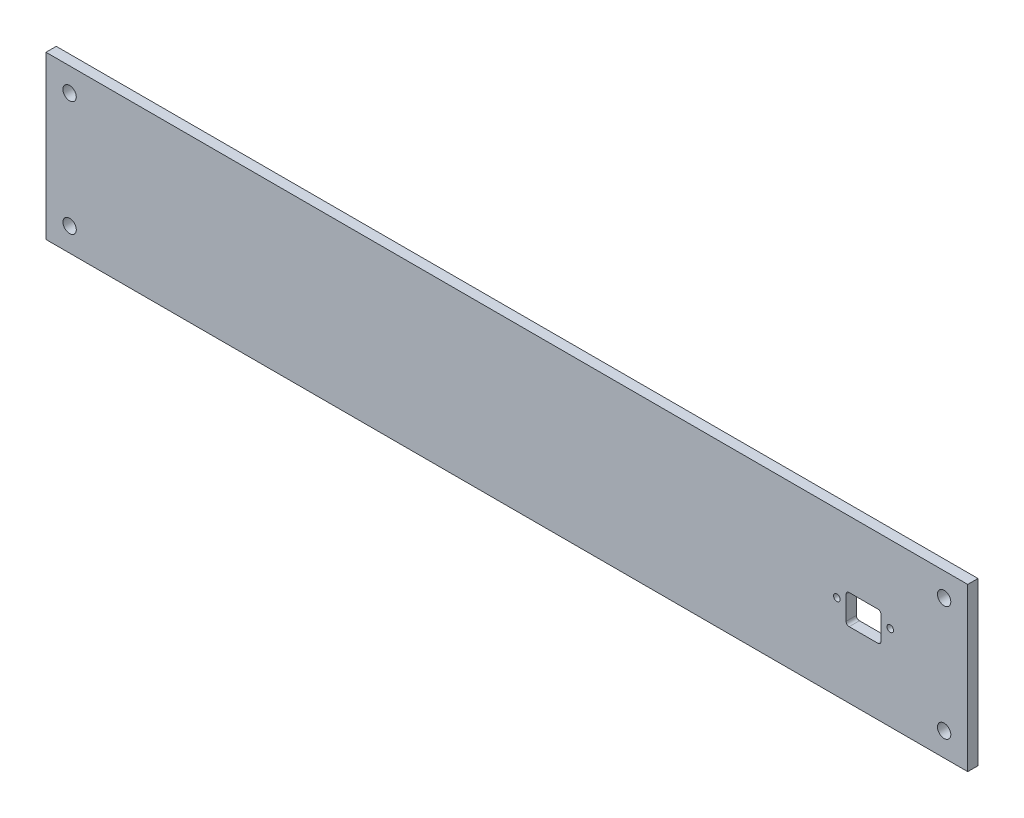
ISO-10303-21;
HEADER;
FILE_DESCRIPTION(('STEP AP214'),'2;1');
FILE_NAME('part.step','',(''),(''),'','','');
FILE_SCHEMA(('AUTOMOTIVE_DESIGN { 1 0 10303 214 1 1 1 1 }'));
ENDSEC;
DATA;
#1=APPLICATION_CONTEXT('core data for automotive mechanical design processes');
#2=APPLICATION_PROTOCOL_DEFINITION('international standard','automotive_design',2000,#1);
#3=PRODUCT_CONTEXT('',#1,'mechanical');
#4=PRODUCT('Part','Part','',(#3));
#5=PRODUCT_RELATED_PRODUCT_CATEGORY('part','',(#4));
#6=PRODUCT_DEFINITION_FORMATION('','',#4);
#7=PRODUCT_DEFINITION_CONTEXT('part definition',#1,'design');
#8=PRODUCT_DEFINITION('design','',#6,#7);
#9=PRODUCT_DEFINITION_SHAPE('','',#8);
#10=(LENGTH_UNIT() NAMED_UNIT(*) SI_UNIT(.MILLI.,.METRE.));
#11=(NAMED_UNIT(*) PLANE_ANGLE_UNIT() SI_UNIT($,.RADIAN.));
#12=(NAMED_UNIT(*) SI_UNIT($,.STERADIAN.) SOLID_ANGLE_UNIT());
#13=UNCERTAINTY_MEASURE_WITH_UNIT(LENGTH_MEASURE(1.E-05),#10,'distance_accuracy_value','');
#14=(GEOMETRIC_REPRESENTATION_CONTEXT(3) GLOBAL_UNCERTAINTY_ASSIGNED_CONTEXT((#13)) GLOBAL_UNIT_ASSIGNED_CONTEXT((#10,
#11,#12)) REPRESENTATION_CONTEXT('',''));
#15=CARTESIAN_POINT('',(0.,0.,0.));
#16=DIRECTION('',(0.,0.,1.));
#17=DIRECTION('',(1.,0.,0.));
#18=AXIS2_PLACEMENT_3D('',#15,#16,#17);
#19=CARTESIAN_POINT('',(0.,0.,5.));
#20=DIRECTION('',(0.,0.,-1.));
#21=DIRECTION('',(-1.,0.,0.));
#22=AXIS2_PLACEMENT_3D('',#19,#20,#21);
#23=PLANE('',#22);
#24=CARTESIAN_POINT('',(411.246939645977,41.5,5.));
#25=DIRECTION('',(0.,0.,1.));
#26=DIRECTION('',(-1.,0.,0.));
#27=AXIS2_PLACEMENT_3D('',#24,#25,#26);
#28=CIRCLE('',#27,1.59999999999996);
#29=CARTESIAN_POINT('',(409.646939645977,41.5,5.));
#30=VERTEX_POINT('',#29);
#31=EDGE_CURVE('E229',#30,#30,#28,.T.);
#32=ORIENTED_EDGE('',*,*,#31,.F.);
#33=EDGE_LOOP('',(#32));
#34=FACE_BOUND('',#33,.T.);
#35=CARTESIAN_POINT('',(385.246939645977,41.5,5.));
#36=DIRECTION('',(0.,0.,1.));
#37=DIRECTION('',(1.,0.,0.));
#38=AXIS2_PLACEMENT_3D('',#35,#36,#37);
#39=CIRCLE('',#38,1.59999999999996);
#40=CARTESIAN_POINT('',(386.846939645977,41.5,5.));
#41=VERTEX_POINT('',#40);
#42=EDGE_CURVE('E236',#41,#41,#39,.T.);
#43=ORIENTED_EDGE('',*,*,#42,.F.);
#44=EDGE_LOOP('',(#43));
#45=FACE_BOUND('',#44,.T.);
#46=CARTESIAN_POINT('',(437.5,11.5,5.));
#47=DIRECTION('',(0.,0.,1.));
#48=DIRECTION('',(1.,0.,0.));
#49=AXIS2_PLACEMENT_3D('',#46,#47,#48);
#50=CIRCLE('',#49,3.24999999999995);
#51=CARTESIAN_POINT('',(440.75,11.5,5.));
#52=VERTEX_POINT('',#51);
#53=EDGE_CURVE('E255',#52,#52,#50,.T.);
#54=ORIENTED_EDGE('',*,*,#53,.F.);
#55=EDGE_LOOP('',(#54));
#56=FACE_BOUND('',#55,.T.);
#57=CARTESIAN_POINT('',(11.5,11.5,5.));
#58=DIRECTION('',(0.,0.,1.));
#59=DIRECTION('',(-1.,0.,0.));
#60=AXIS2_PLACEMENT_3D('',#57,#58,#59);
#61=CIRCLE('',#60,3.25);
#62=CARTESIAN_POINT('',(8.25,11.5,5.));
#63=VERTEX_POINT('',#62);
#64=EDGE_CURVE('E254',#63,#63,#61,.T.);
#65=ORIENTED_EDGE('',*,*,#64,.F.);
#66=EDGE_LOOP('',(#65));
#67=FACE_BOUND('',#66,.T.);
#68=CARTESIAN_POINT('',(437.5,67.5,5.));
#69=DIRECTION('',(0.,0.,1.));
#70=DIRECTION('',(-1.,0.,0.));
#71=AXIS2_PLACEMENT_3D('',#68,#69,#70);
#72=CIRCLE('',#71,3.24999999999995);
#73=CARTESIAN_POINT('',(434.25,67.5,5.));
#74=VERTEX_POINT('',#73);
#75=EDGE_CURVE('E257',#74,#74,#72,.T.);
#76=ORIENTED_EDGE('',*,*,#75,.F.);
#77=EDGE_LOOP('',(#76));
#78=FACE_BOUND('',#77,.T.);
#79=CARTESIAN_POINT('',(11.5,67.5,5.));
#80=DIRECTION('',(0.,0.,1.));
#81=DIRECTION('',(1.,0.,0.));
#82=AXIS2_PLACEMENT_3D('',#79,#80,#81);
#83=CIRCLE('',#82,3.25);
#84=CARTESIAN_POINT('',(14.75,67.5,5.));
#85=VERTEX_POINT('',#84);
#86=EDGE_CURVE('E266',#85,#85,#83,.T.);
#87=ORIENTED_EDGE('',*,*,#86,.F.);
#88=EDGE_LOOP('',(#87));
#89=FACE_BOUND('',#88,.T.);
#90=DIRECTION('',(1.,0.,0.));
#91=VECTOR('',#90,1.);
#92=CARTESIAN_POINT('',(449.,0.,5.));
#93=LINE('',#92,#91);
#94=CARTESIAN_POINT('',(0.,0.,5.));
#95=VERTEX_POINT('',#94);
#96=CARTESIAN_POINT('',(449.,0.,5.));
#97=VERTEX_POINT('',#96);
#98=EDGE_CURVE('E292',#95,#97,#93,.T.);
#99=ORIENTED_EDGE('',*,*,#98,.T.);
#100=DIRECTION('',(0.,1.,0.));
#101=VECTOR('',#100,1.);
#102=CARTESIAN_POINT('',(449.,79.,5.));
#103=LINE('',#102,#101);
#104=CARTESIAN_POINT('',(449.,79.,5.));
#105=VERTEX_POINT('',#104);
#106=EDGE_CURVE('E294',#97,#105,#103,.T.);
#107=ORIENTED_EDGE('',*,*,#106,.T.);
#108=DIRECTION('',(-1.,0.,0.));
#109=VECTOR('',#108,1.);
#110=CARTESIAN_POINT('',(0.,79.,5.));
#111=LINE('',#110,#109);
#112=CARTESIAN_POINT('',(0.,79.,5.));
#113=VERTEX_POINT('',#112);
#114=EDGE_CURVE('E311',#105,#113,#111,.T.);
#115=ORIENTED_EDGE('',*,*,#114,.T.);
#116=DIRECTION('',(0.,-1.,0.));
#117=VECTOR('',#116,1.);
#118=CARTESIAN_POINT('',(0.,0.,5.));
#119=LINE('',#118,#117);
#120=EDGE_CURVE('E297',#113,#95,#119,.T.);
#121=ORIENTED_EDGE('',*,*,#120,.T.);
#122=EDGE_LOOP('',(#99,#107,#115,#121));
#123=FACE_BOUND('',#122,.T.);
#124=CARTESIAN_POINT('',(405.246939645977,45.2,5.));
#125=DIRECTION('',(0.,0.,1.));
#126=DIRECTION('',(1.,0.,0.));
#127=AXIS2_PLACEMENT_3D('',#124,#125,#126);
#128=CIRCLE('',#127,1.5);
#129=CARTESIAN_POINT('',(406.746939645977,45.2,5.));
#130=VERTEX_POINT('',#129);
#131=CARTESIAN_POINT('',(405.246939645977,46.7,5.));
#132=VERTEX_POINT('',#131);
#133=EDGE_CURVE('E141',#130,#132,#128,.T.);
#134=ORIENTED_EDGE('',*,*,#133,.F.);
#135=DIRECTION('',(0.,1.,0.));
#136=VECTOR('',#135,1.);
#137=CARTESIAN_POINT('',(406.746939645977,33.8,5.));
#138=LINE('',#137,#136);
#139=CARTESIAN_POINT('',(406.746939645977,33.8,5.));
#140=VERTEX_POINT('',#139);
#141=EDGE_CURVE('E196',#140,#130,#138,.T.);
#142=ORIENTED_EDGE('',*,*,#141,.F.);
#143=CARTESIAN_POINT('',(405.246939645977,33.8,5.));
#144=DIRECTION('',(0.,0.,1.));
#145=DIRECTION('',(-1.,0.,0.));
#146=AXIS2_PLACEMENT_3D('',#143,#144,#145);
#147=CIRCLE('',#146,1.5);
#148=CARTESIAN_POINT('',(405.246939645977,32.3,5.));
#149=VERTEX_POINT('',#148);
#150=EDGE_CURVE('E192',#149,#140,#147,.T.);
#151=ORIENTED_EDGE('',*,*,#150,.F.);
#152=DIRECTION('',(1.,0.,0.));
#153=VECTOR('',#152,1.);
#154=CARTESIAN_POINT('',(405.246939645977,32.3,5.));
#155=LINE('',#154,#153);
#156=CARTESIAN_POINT('',(391.246939645977,32.3,5.));
#157=VERTEX_POINT('',#156);
#158=EDGE_CURVE('E187',#157,#149,#155,.T.);
#159=ORIENTED_EDGE('',*,*,#158,.F.);
#160=CARTESIAN_POINT('',(391.246939645977,33.8,5.));
#161=DIRECTION('',(0.,0.,1.));
#162=DIRECTION('',(-1.,0.,0.));
#163=AXIS2_PLACEMENT_3D('',#160,#161,#162);
#164=CIRCLE('',#163,1.5);
#165=CARTESIAN_POINT('',(389.746939645977,33.8,5.));
#166=VERTEX_POINT('',#165);
#167=EDGE_CURVE('E184',#166,#157,#164,.T.);
#168=ORIENTED_EDGE('',*,*,#167,.F.);
#169=DIRECTION('',(0.,-1.,0.));
#170=VECTOR('',#169,1.);
#171=CARTESIAN_POINT('',(389.746939645977,45.2,5.));
#172=LINE('',#171,#170);
#173=CARTESIAN_POINT('',(389.746939645977,45.2,5.));
#174=VERTEX_POINT('',#173);
#175=EDGE_CURVE('E168',#174,#166,#172,.T.);
#176=ORIENTED_EDGE('',*,*,#175,.F.);
#177=CARTESIAN_POINT('',(391.246939645977,45.2,5.));
#178=DIRECTION('',(0.,0.,1.));
#179=DIRECTION('',(-1.,0.,0.));
#180=AXIS2_PLACEMENT_3D('',#177,#178,#179);
#181=CIRCLE('',#180,1.5);
#182=CARTESIAN_POINT('',(391.246939645977,46.7,5.));
#183=VERTEX_POINT('',#182);
#184=EDGE_CURVE('E162',#183,#174,#181,.T.);
#185=ORIENTED_EDGE('',*,*,#184,.F.);
#186=DIRECTION('',(-1.,0.,0.));
#187=VECTOR('',#186,1.);
#188=CARTESIAN_POINT('',(405.246939645977,46.7,5.));
#189=LINE('',#188,#187);
#190=EDGE_CURVE('E150',#132,#183,#189,.T.);
#191=ORIENTED_EDGE('',*,*,#190,.F.);
#192=EDGE_LOOP('',(#134,#142,#151,#159,#168,#176,#185,#191));
#193=FACE_BOUND('',#192,.T.);
#194=ADVANCED_FACE('F42',(#34,#45,#56,#67,#78,#89,#123,#193),#23,.F.);
#195=CARTESIAN_POINT('',(0.,0.,0.));
#196=DIRECTION('',(0.,0.,-1.));
#197=DIRECTION('',(-1.,0.,0.));
#198=AXIS2_PLACEMENT_3D('',#195,#196,#197);
#199=PLANE('',#198);
#200=CARTESIAN_POINT('',(385.246939645977,41.5,0.));
#201=DIRECTION('',(0.,0.,1.));
#202=DIRECTION('',(1.,0.,0.));
#203=AXIS2_PLACEMENT_3D('',#200,#201,#202);
#204=CIRCLE('',#203,1.59999999999996);
#205=CARTESIAN_POINT('',(386.846939645977,41.5,0.));
#206=VERTEX_POINT('',#205);
#207=EDGE_CURVE('E233',#206,#206,#204,.T.);
#208=ORIENTED_EDGE('',*,*,#207,.T.);
#209=EDGE_LOOP('',(#208));
#210=FACE_BOUND('',#209,.T.);
#211=CARTESIAN_POINT('',(11.5,11.5,0.));
#212=DIRECTION('',(0.,0.,1.));
#213=DIRECTION('',(-1.,0.,0.));
#214=AXIS2_PLACEMENT_3D('',#211,#212,#213);
#215=CIRCLE('',#214,3.25);
#216=CARTESIAN_POINT('',(8.25,11.5,0.));
#217=VERTEX_POINT('',#216);
#218=EDGE_CURVE('E248',#217,#217,#215,.T.);
#219=ORIENTED_EDGE('',*,*,#218,.T.);
#220=EDGE_LOOP('',(#219));
#221=FACE_BOUND('',#220,.T.);
#222=CARTESIAN_POINT('',(11.5,67.5,0.));
#223=DIRECTION('',(0.,0.,1.));
#224=DIRECTION('',(1.,0.,0.));
#225=AXIS2_PLACEMENT_3D('',#222,#223,#224);
#226=CIRCLE('',#225,3.25);
#227=CARTESIAN_POINT('',(14.75,67.5,0.));
#228=VERTEX_POINT('',#227);
#229=EDGE_CURVE('E260',#228,#228,#226,.T.);
#230=ORIENTED_EDGE('',*,*,#229,.T.);
#231=EDGE_LOOP('',(#230));
#232=FACE_BOUND('',#231,.T.);
#233=DIRECTION('',(1.,0.,0.));
#234=VECTOR('',#233,1.);
#235=CARTESIAN_POINT('',(449.,0.,0.));
#236=LINE('',#235,#234);
#237=CARTESIAN_POINT('',(0.,0.,0.));
#238=VERTEX_POINT('',#237);
#239=CARTESIAN_POINT('',(449.,0.,0.));
#240=VERTEX_POINT('',#239);
#241=EDGE_CURVE('E305',#238,#240,#236,.T.);
#242=ORIENTED_EDGE('',*,*,#241,.F.);
#243=DIRECTION('',(0.,-1.,0.));
#244=VECTOR('',#243,1.);
#245=CARTESIAN_POINT('',(0.,0.,0.));
#246=LINE('',#245,#244);
#247=CARTESIAN_POINT('',(0.,79.,0.));
#248=VERTEX_POINT('',#247);
#249=EDGE_CURVE('E301',#248,#238,#246,.T.);
#250=ORIENTED_EDGE('',*,*,#249,.F.);
#251=DIRECTION('',(-1.,0.,0.));
#252=VECTOR('',#251,1.);
#253=CARTESIAN_POINT('',(0.,79.,0.));
#254=LINE('',#253,#252);
#255=CARTESIAN_POINT('',(449.,79.,0.));
#256=VERTEX_POINT('',#255);
#257=EDGE_CURVE('E319',#256,#248,#254,.T.);
#258=ORIENTED_EDGE('',*,*,#257,.F.);
#259=DIRECTION('',(0.,1.,0.));
#260=VECTOR('',#259,1.);
#261=CARTESIAN_POINT('',(449.,79.,0.));
#262=LINE('',#261,#260);
#263=EDGE_CURVE('E308',#240,#256,#262,.T.);
#264=ORIENTED_EDGE('',*,*,#263,.F.);
#265=EDGE_LOOP('',(#242,#250,#258,#264));
#266=FACE_BOUND('',#265,.T.);
#267=CARTESIAN_POINT('',(437.5,67.5,0.));
#268=DIRECTION('',(0.,0.,1.));
#269=DIRECTION('',(-1.,0.,0.));
#270=AXIS2_PLACEMENT_3D('',#267,#268,#269);
#271=CIRCLE('',#270,3.24999999999995);
#272=CARTESIAN_POINT('',(434.25,67.5,0.));
#273=VERTEX_POINT('',#272);
#274=EDGE_CURVE('E261',#273,#273,#271,.T.);
#275=ORIENTED_EDGE('',*,*,#274,.T.);
#276=EDGE_LOOP('',(#275));
#277=FACE_BOUND('',#276,.T.);
#278=CARTESIAN_POINT('',(437.5,11.5,0.));
#279=DIRECTION('',(0.,0.,1.));
#280=DIRECTION('',(1.,0.,0.));
#281=AXIS2_PLACEMENT_3D('',#278,#279,#280);
#282=CIRCLE('',#281,3.24999999999995);
#283=CARTESIAN_POINT('',(440.75,11.5,0.));
#284=VERTEX_POINT('',#283);
#285=EDGE_CURVE('E241',#284,#284,#282,.T.);
#286=ORIENTED_EDGE('',*,*,#285,.T.);
#287=EDGE_LOOP('',(#286));
#288=FACE_BOUND('',#287,.T.);
#289=CARTESIAN_POINT('',(411.246939645977,41.5,0.));
#290=DIRECTION('',(0.,0.,1.));
#291=DIRECTION('',(-1.,0.,0.));
#292=AXIS2_PLACEMENT_3D('',#289,#290,#291);
#293=CIRCLE('',#292,1.59999999999996);
#294=CARTESIAN_POINT('',(409.646939645977,41.5,0.));
#295=VERTEX_POINT('',#294);
#296=EDGE_CURVE('E157',#295,#295,#293,.T.);
#297=ORIENTED_EDGE('',*,*,#296,.T.);
#298=EDGE_LOOP('',(#297));
#299=FACE_BOUND('',#298,.T.);
#300=DIRECTION('',(0.,1.,0.));
#301=VECTOR('',#300,1.);
#302=CARTESIAN_POINT('',(406.746939645977,33.8,0.));
#303=LINE('',#302,#301);
#304=CARTESIAN_POINT('',(406.746939645977,33.8,0.));
#305=VERTEX_POINT('',#304);
#306=CARTESIAN_POINT('',(406.746939645977,45.2,0.));
#307=VERTEX_POINT('',#306);
#308=EDGE_CURVE('E151',#305,#307,#303,.T.);
#309=ORIENTED_EDGE('',*,*,#308,.T.);
#310=CARTESIAN_POINT('',(405.246939645977,45.2,0.));
#311=DIRECTION('',(0.,0.,1.));
#312=DIRECTION('',(1.,0.,0.));
#313=AXIS2_PLACEMENT_3D('',#310,#311,#312);
#314=CIRCLE('',#313,1.5);
#315=CARTESIAN_POINT('',(405.246939645977,46.7,0.));
#316=VERTEX_POINT('',#315);
#317=EDGE_CURVE('E68',#307,#316,#314,.T.);
#318=ORIENTED_EDGE('',*,*,#317,.T.);
#319=DIRECTION('',(-1.,0.,0.));
#320=VECTOR('',#319,1.);
#321=CARTESIAN_POINT('',(405.246939645977,46.7,0.));
#322=LINE('',#321,#320);
#323=CARTESIAN_POINT('',(391.246939645977,46.7,0.));
#324=VERTEX_POINT('',#323);
#325=EDGE_CURVE('E156',#316,#324,#322,.T.);
#326=ORIENTED_EDGE('',*,*,#325,.T.);
#327=CARTESIAN_POINT('',(391.246939645977,45.2,0.));
#328=DIRECTION('',(0.,0.,1.));
#329=DIRECTION('',(-1.,0.,0.));
#330=AXIS2_PLACEMENT_3D('',#327,#328,#329);
#331=CIRCLE('',#330,1.5);
#332=CARTESIAN_POINT('',(389.746939645977,45.2,0.));
#333=VERTEX_POINT('',#332);
#334=EDGE_CURVE('E202',#324,#333,#331,.T.);
#335=ORIENTED_EDGE('',*,*,#334,.T.);
#336=DIRECTION('',(0.,-1.,0.));
#337=VECTOR('',#336,1.);
#338=CARTESIAN_POINT('',(389.746939645977,45.2,0.));
#339=LINE('',#338,#337);
#340=CARTESIAN_POINT('',(389.746939645977,33.8,0.));
#341=VERTEX_POINT('',#340);
#342=EDGE_CURVE('E205',#333,#341,#339,.T.);
#343=ORIENTED_EDGE('',*,*,#342,.T.);
#344=CARTESIAN_POINT('',(391.246939645977,33.8,0.));
#345=DIRECTION('',(0.,0.,1.));
#346=DIRECTION('',(-1.,0.,0.));
#347=AXIS2_PLACEMENT_3D('',#344,#345,#346);
#348=CIRCLE('',#347,1.5);
#349=CARTESIAN_POINT('',(391.246939645977,32.3,0.));
#350=VERTEX_POINT('',#349);
#351=EDGE_CURVE('E208',#341,#350,#348,.T.);
#352=ORIENTED_EDGE('',*,*,#351,.T.);
#353=DIRECTION('',(1.,0.,0.));
#354=VECTOR('',#353,1.);
#355=CARTESIAN_POINT('',(405.246939645977,32.3,0.));
#356=LINE('',#355,#354);
#357=CARTESIAN_POINT('',(405.246939645977,32.3,0.));
#358=VERTEX_POINT('',#357);
#359=EDGE_CURVE('E211',#350,#358,#356,.T.);
#360=ORIENTED_EDGE('',*,*,#359,.T.);
#361=CARTESIAN_POINT('',(405.246939645977,33.8,0.));
#362=DIRECTION('',(0.,0.,1.));
#363=DIRECTION('',(-1.,0.,0.));
#364=AXIS2_PLACEMENT_3D('',#361,#362,#363);
#365=CIRCLE('',#364,1.5);
#366=EDGE_CURVE('E214',#358,#305,#365,.T.);
#367=ORIENTED_EDGE('',*,*,#366,.T.);
#368=EDGE_LOOP('',(#309,#318,#326,#335,#343,#352,#360,#367));
#369=FACE_BOUND('',#368,.T.);
#370=ADVANCED_FACE('F279',(#210,#221,#232,#266,#277,#288,#299,#369),#199,.T.);
#371=CARTESIAN_POINT('',(449.,0.,5.));
#372=DIRECTION('',(0.,1.,0.));
#373=DIRECTION('',(-1.,0.,0.));
#374=AXIS2_PLACEMENT_3D('',#371,#372,#373);
#375=PLANE('',#374);
#376=ORIENTED_EDGE('',*,*,#241,.T.);
#377=DIRECTION('',(0.,0.,-1.));
#378=VECTOR('',#377,1.);
#379=CARTESIAN_POINT('',(449.,0.,5.));
#380=LINE('',#379,#378);
#381=EDGE_CURVE('E12',#97,#240,#380,.T.);
#382=ORIENTED_EDGE('',*,*,#381,.F.);
#383=ORIENTED_EDGE('',*,*,#98,.F.);
#384=DIRECTION('',(0.,0.,-1.));
#385=VECTOR('',#384,1.);
#386=CARTESIAN_POINT('',(0.,0.,5.));
#387=LINE('',#386,#385);
#388=EDGE_CURVE('E316',#95,#238,#387,.T.);
#389=ORIENTED_EDGE('',*,*,#388,.T.);
#390=EDGE_LOOP('',(#376,#382,#383,#389));
#391=FACE_BOUND('',#390,.T.);
#392=ADVANCED_FACE('F44',(#391),#375,.F.);
#393=CARTESIAN_POINT('',(449.,79.,5.));
#394=DIRECTION('',(-1.,0.,0.));
#395=DIRECTION('',(0.,0.,1.));
#396=AXIS2_PLACEMENT_3D('',#393,#394,#395);
#397=PLANE('',#396);
#398=ORIENTED_EDGE('',*,*,#263,.T.);
#399=DIRECTION('',(0.,0.,-1.));
#400=VECTOR('',#399,1.);
#401=CARTESIAN_POINT('',(449.,79.,5.));
#402=LINE('',#401,#400);
#403=EDGE_CURVE('E50',#105,#256,#402,.T.);
#404=ORIENTED_EDGE('',*,*,#403,.F.);
#405=ORIENTED_EDGE('',*,*,#106,.F.);
#406=ORIENTED_EDGE('',*,*,#381,.T.);
#407=EDGE_LOOP('',(#398,#404,#405,#406));
#408=FACE_BOUND('',#407,.T.);
#409=ADVANCED_FACE('F307',(#408),#397,.F.);
#410=CARTESIAN_POINT('',(0.,79.,5.));
#411=DIRECTION('',(0.,-1.,0.));
#412=DIRECTION('',(0.,0.,-1.));
#413=AXIS2_PLACEMENT_3D('',#410,#411,#412);
#414=PLANE('',#413);
#415=ORIENTED_EDGE('',*,*,#257,.T.);
#416=DIRECTION('',(0.,0.,-1.));
#417=VECTOR('',#416,1.);
#418=CARTESIAN_POINT('',(0.,79.,5.));
#419=LINE('',#418,#417);
#420=EDGE_CURVE('E323',#113,#248,#419,.T.);
#421=ORIENTED_EDGE('',*,*,#420,.F.);
#422=ORIENTED_EDGE('',*,*,#114,.F.);
#423=ORIENTED_EDGE('',*,*,#403,.T.);
#424=EDGE_LOOP('',(#415,#421,#422,#423));
#425=FACE_BOUND('',#424,.T.);
#426=ADVANCED_FACE('F327',(#425),#414,.F.);
#427=CARTESIAN_POINT('',(0.,0.,5.));
#428=DIRECTION('',(1.,0.,0.));
#429=DIRECTION('',(0.,1.,0.));
#430=AXIS2_PLACEMENT_3D('',#427,#428,#429);
#431=PLANE('',#430);
#432=ORIENTED_EDGE('',*,*,#249,.T.);
#433=ORIENTED_EDGE('',*,*,#388,.F.);
#434=ORIENTED_EDGE('',*,*,#120,.F.);
#435=ORIENTED_EDGE('',*,*,#420,.T.);
#436=EDGE_LOOP('',(#432,#433,#434,#435));
#437=FACE_BOUND('',#436,.T.);
#438=ADVANCED_FACE('F333',(#437),#431,.F.);
#439=CARTESIAN_POINT('',(11.5,67.5,5.));
#440=DIRECTION('',(0.,0.,-1.));
#441=DIRECTION('',(-1.,0.,0.));
#442=AXIS2_PLACEMENT_3D('',#439,#440,#441);
#443=CYLINDRICAL_SURFACE('',#442,3.25);
#444=ORIENTED_EDGE('',*,*,#86,.T.);
#445=EDGE_LOOP('',(#444));
#446=FACE_BOUND('',#445,.T.);
#447=ORIENTED_EDGE('',*,*,#229,.F.);
#448=EDGE_LOOP('',(#447));
#449=FACE_BOUND('',#448,.T.);
#450=ADVANCED_FACE('F335',(#446,#449),#443,.F.);
#451=CARTESIAN_POINT('',(437.5,67.5,5.));
#452=DIRECTION('',(0.,0.,-1.));
#453=DIRECTION('',(-1.,0.,0.));
#454=AXIS2_PLACEMENT_3D('',#451,#452,#453);
#455=CYLINDRICAL_SURFACE('',#454,3.24999999999995);
#456=ORIENTED_EDGE('',*,*,#75,.T.);
#457=EDGE_LOOP('',(#456));
#458=FACE_BOUND('',#457,.T.);
#459=ORIENTED_EDGE('',*,*,#274,.F.);
#460=EDGE_LOOP('',(#459));
#461=FACE_BOUND('',#460,.T.);
#462=ADVANCED_FACE('F341',(#458,#461),#455,.F.);
#463=CARTESIAN_POINT('',(11.5,11.5,5.));
#464=DIRECTION('',(0.,0.,-1.));
#465=DIRECTION('',(-1.,0.,0.));
#466=AXIS2_PLACEMENT_3D('',#463,#464,#465);
#467=CYLINDRICAL_SURFACE('',#466,3.25);
#468=ORIENTED_EDGE('',*,*,#64,.T.);
#469=EDGE_LOOP('',(#468));
#470=FACE_BOUND('',#469,.T.);
#471=ORIENTED_EDGE('',*,*,#218,.F.);
#472=EDGE_LOOP('',(#471));
#473=FACE_BOUND('',#472,.T.);
#474=ADVANCED_FACE('F367',(#470,#473),#467,.F.);
#475=CARTESIAN_POINT('',(437.5,11.5,5.));
#476=DIRECTION('',(0.,0.,-1.));
#477=DIRECTION('',(-1.,0.,0.));
#478=AXIS2_PLACEMENT_3D('',#475,#476,#477);
#479=CYLINDRICAL_SURFACE('',#478,3.24999999999995);
#480=ORIENTED_EDGE('',*,*,#53,.T.);
#481=EDGE_LOOP('',(#480));
#482=FACE_BOUND('',#481,.T.);
#483=ORIENTED_EDGE('',*,*,#285,.F.);
#484=EDGE_LOOP('',(#483));
#485=FACE_BOUND('',#484,.T.);
#486=ADVANCED_FACE('F274',(#482,#485),#479,.F.);
#487=CARTESIAN_POINT('',(385.246939645977,41.5,5.));
#488=DIRECTION('',(0.,0.,-1.));
#489=DIRECTION('',(-1.,0.,0.));
#490=AXIS2_PLACEMENT_3D('',#487,#488,#489);
#491=CYLINDRICAL_SURFACE('',#490,1.59999999999996);
#492=ORIENTED_EDGE('',*,*,#42,.T.);
#493=EDGE_LOOP('',(#492));
#494=FACE_BOUND('',#493,.T.);
#495=ORIENTED_EDGE('',*,*,#207,.F.);
#496=EDGE_LOOP('',(#495));
#497=FACE_BOUND('',#496,.T.);
#498=ADVANCED_FACE('F375',(#494,#497),#491,.F.);
#499=CARTESIAN_POINT('',(411.246939645977,41.5,5.));
#500=DIRECTION('',(0.,0.,-1.));
#501=DIRECTION('',(-1.,0.,0.));
#502=AXIS2_PLACEMENT_3D('',#499,#500,#501);
#503=CYLINDRICAL_SURFACE('',#502,1.59999999999996);
#504=ORIENTED_EDGE('',*,*,#31,.T.);
#505=EDGE_LOOP('',(#504));
#506=FACE_BOUND('',#505,.T.);
#507=ORIENTED_EDGE('',*,*,#296,.F.);
#508=EDGE_LOOP('',(#507));
#509=FACE_BOUND('',#508,.T.);
#510=ADVANCED_FACE('F382',(#506,#509),#503,.F.);
#511=CARTESIAN_POINT('',(405.246939645977,45.2,5.));
#512=DIRECTION('',(0.,0.,-1.));
#513=DIRECTION('',(-1.,0.,0.));
#514=AXIS2_PLACEMENT_3D('',#511,#512,#513);
#515=CYLINDRICAL_SURFACE('',#514,1.5);
#516=ORIENTED_EDGE('',*,*,#317,.F.);
#517=DIRECTION('',(0.,0.,-1.));
#518=VECTOR('',#517,1.);
#519=CARTESIAN_POINT('',(406.746939645977,45.2,5.));
#520=LINE('',#519,#518);
#521=EDGE_CURVE('E145',#130,#307,#520,.T.);
#522=ORIENTED_EDGE('',*,*,#521,.F.);
#523=ORIENTED_EDGE('',*,*,#133,.T.);
#524=DIRECTION('',(0.,0.,-1.));
#525=VECTOR('',#524,1.);
#526=CARTESIAN_POINT('',(405.246939645977,46.7,5.));
#527=LINE('',#526,#525);
#528=EDGE_CURVE('E144',#132,#316,#527,.T.);
#529=ORIENTED_EDGE('',*,*,#528,.T.);
#530=EDGE_LOOP('',(#516,#522,#523,#529));
#531=FACE_BOUND('',#530,.T.);
#532=ADVANCED_FACE('F143',(#531),#515,.F.);
#533=CARTESIAN_POINT('',(405.246939645977,46.7,5.));
#534=DIRECTION('',(0.,-1.,0.));
#535=DIRECTION('',(0.,0.,-1.));
#536=AXIS2_PLACEMENT_3D('',#533,#534,#535);
#537=PLANE('',#536);
#538=ORIENTED_EDGE('',*,*,#325,.F.);
#539=ORIENTED_EDGE('',*,*,#528,.F.);
#540=ORIENTED_EDGE('',*,*,#190,.T.);
#541=DIRECTION('',(0.,0.,-1.));
#542=VECTOR('',#541,1.);
#543=CARTESIAN_POINT('',(391.246939645977,46.7,5.));
#544=LINE('',#543,#542);
#545=EDGE_CURVE('E158',#183,#324,#544,.T.);
#546=ORIENTED_EDGE('',*,*,#545,.T.);
#547=EDGE_LOOP('',(#538,#539,#540,#546));
#548=FACE_BOUND('',#547,.T.);
#549=ADVANCED_FACE('F153',(#548),#537,.T.);
#550=CARTESIAN_POINT('',(391.246939645977,45.2,5.));
#551=DIRECTION('',(0.,0.,-1.));
#552=DIRECTION('',(-1.,0.,0.));
#553=AXIS2_PLACEMENT_3D('',#550,#551,#552);
#554=CYLINDRICAL_SURFACE('',#553,1.5);
#555=ORIENTED_EDGE('',*,*,#334,.F.);
#556=ORIENTED_EDGE('',*,*,#545,.F.);
#557=ORIENTED_EDGE('',*,*,#184,.T.);
#558=DIRECTION('',(0.,0.,-1.));
#559=VECTOR('',#558,1.);
#560=CARTESIAN_POINT('',(389.746939645977,45.2,5.));
#561=LINE('',#560,#559);
#562=EDGE_CURVE('E227',#174,#333,#561,.T.);
#563=ORIENTED_EDGE('',*,*,#562,.T.);
#564=EDGE_LOOP('',(#555,#556,#557,#563));
#565=FACE_BOUND('',#564,.T.);
#566=ADVANCED_FACE('F391',(#565),#554,.F.);
#567=CARTESIAN_POINT('',(389.746939645977,45.2,5.));
#568=DIRECTION('',(1.,0.,0.));
#569=DIRECTION('',(0.,0.,-1.));
#570=AXIS2_PLACEMENT_3D('',#567,#568,#569);
#571=PLANE('',#570);
#572=ORIENTED_EDGE('',*,*,#342,.F.);
#573=ORIENTED_EDGE('',*,*,#562,.F.);
#574=ORIENTED_EDGE('',*,*,#175,.T.);
#575=DIRECTION('',(0.,0.,-1.));
#576=VECTOR('',#575,1.);
#577=CARTESIAN_POINT('',(389.746939645977,33.8,5.));
#578=LINE('',#577,#576);
#579=EDGE_CURVE('E225',#166,#341,#578,.T.);
#580=ORIENTED_EDGE('',*,*,#579,.T.);
#581=EDGE_LOOP('',(#572,#573,#574,#580));
#582=FACE_BOUND('',#581,.T.);
#583=ADVANCED_FACE('F394',(#582),#571,.T.);
#584=CARTESIAN_POINT('',(391.246939645977,33.8,5.));
#585=DIRECTION('',(0.,0.,-1.));
#586=DIRECTION('',(-1.,0.,0.));
#587=AXIS2_PLACEMENT_3D('',#584,#585,#586);
#588=CYLINDRICAL_SURFACE('',#587,1.5);
#589=ORIENTED_EDGE('',*,*,#351,.F.);
#590=ORIENTED_EDGE('',*,*,#579,.F.);
#591=ORIENTED_EDGE('',*,*,#167,.T.);
#592=DIRECTION('',(0.,0.,-1.));
#593=VECTOR('',#592,1.);
#594=CARTESIAN_POINT('',(391.246939645977,32.3,5.));
#595=LINE('',#594,#593);
#596=EDGE_CURVE('E223',#157,#350,#595,.T.);
#597=ORIENTED_EDGE('',*,*,#596,.T.);
#598=EDGE_LOOP('',(#589,#590,#591,#597));
#599=FACE_BOUND('',#598,.T.);
#600=ADVANCED_FACE('F398',(#599),#588,.F.);
#601=CARTESIAN_POINT('',(405.246939645977,32.3,5.));
#602=DIRECTION('',(0.,1.,0.));
#603=DIRECTION('',(0.,0.,1.));
#604=AXIS2_PLACEMENT_3D('',#601,#602,#603);
#605=PLANE('',#604);
#606=ORIENTED_EDGE('',*,*,#359,.F.);
#607=ORIENTED_EDGE('',*,*,#596,.F.);
#608=ORIENTED_EDGE('',*,*,#158,.T.);
#609=DIRECTION('',(0.,0.,-1.));
#610=VECTOR('',#609,1.);
#611=CARTESIAN_POINT('',(405.246939645977,32.3,5.));
#612=LINE('',#611,#610);
#613=EDGE_CURVE('E221',#149,#358,#612,.T.);
#614=ORIENTED_EDGE('',*,*,#613,.T.);
#615=EDGE_LOOP('',(#606,#607,#608,#614));
#616=FACE_BOUND('',#615,.T.);
#617=ADVANCED_FACE('F402',(#616),#605,.T.);
#618=CARTESIAN_POINT('',(405.246939645977,33.8,5.));
#619=DIRECTION('',(0.,0.,-1.));
#620=DIRECTION('',(-1.,0.,0.));
#621=AXIS2_PLACEMENT_3D('',#618,#619,#620);
#622=CYLINDRICAL_SURFACE('',#621,1.5);
#623=ORIENTED_EDGE('',*,*,#366,.F.);
#624=ORIENTED_EDGE('',*,*,#613,.F.);
#625=ORIENTED_EDGE('',*,*,#150,.T.);
#626=DIRECTION('',(0.,0.,-1.));
#627=VECTOR('',#626,1.);
#628=CARTESIAN_POINT('',(406.746939645977,33.8,5.));
#629=LINE('',#628,#627);
#630=EDGE_CURVE('E60',#140,#305,#629,.T.);
#631=ORIENTED_EDGE('',*,*,#630,.T.);
#632=EDGE_LOOP('',(#623,#624,#625,#631));
#633=FACE_BOUND('',#632,.T.);
#634=ADVANCED_FACE('F406',(#633),#622,.F.);
#635=CARTESIAN_POINT('',(406.746939645977,33.8,5.));
#636=DIRECTION('',(-1.,0.,0.));
#637=DIRECTION('',(0.,0.,1.));
#638=AXIS2_PLACEMENT_3D('',#635,#636,#637);
#639=PLANE('',#638);
#640=ORIENTED_EDGE('',*,*,#308,.F.);
#641=ORIENTED_EDGE('',*,*,#630,.F.);
#642=ORIENTED_EDGE('',*,*,#141,.T.);
#643=ORIENTED_EDGE('',*,*,#521,.T.);
#644=EDGE_LOOP('',(#640,#641,#642,#643));
#645=FACE_BOUND('',#644,.T.);
#646=ADVANCED_FACE('F410',(#645),#639,.T.);
#647=CLOSED_SHELL('',(#194,#370,#392,#409,#426,#438,#450,#462,#474,#486,#498,#510,#532,#549,
#566,#583,#600,#617,#634,#646));
#648=MANIFOLD_SOLID_BREP('B2',#647);
#649=ADVANCED_BREP_SHAPE_REPRESENTATION('',(#18,#648),#14);
#650=SHAPE_DEFINITION_REPRESENTATION(#9,#649);
ENDSEC;
END-ISO-10303-21;
